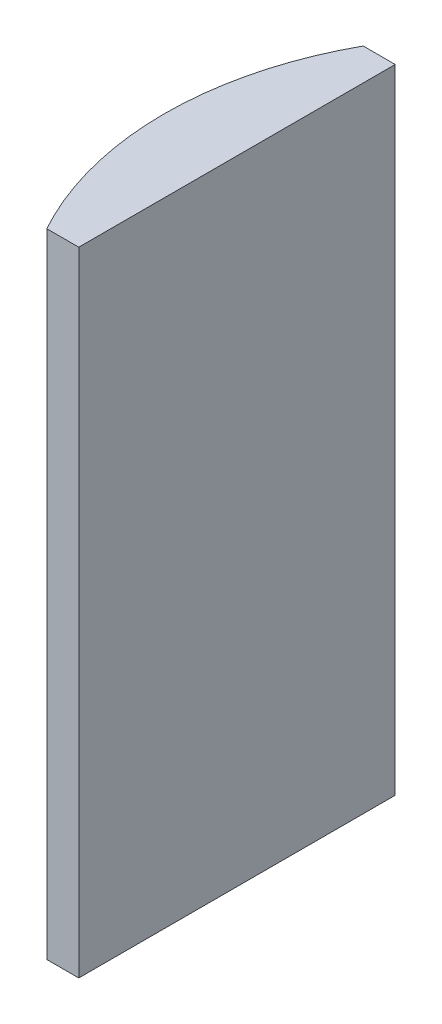
ISO-10303-21;
HEADER;
FILE_DESCRIPTION(('STEP AP214'),'2;1');
FILE_NAME('part.step','',(''),(''),'','','');
FILE_SCHEMA(('AUTOMOTIVE_DESIGN { 1 0 10303 214 1 1 1 1 }'));
ENDSEC;
DATA;
#1=APPLICATION_CONTEXT('core data for automotive mechanical design processes');
#2=APPLICATION_PROTOCOL_DEFINITION('international standard','automotive_design',2000,#1);
#3=PRODUCT_CONTEXT('',#1,'mechanical');
#4=PRODUCT('Part','Part','',(#3));
#5=PRODUCT_RELATED_PRODUCT_CATEGORY('part','',(#4));
#6=PRODUCT_DEFINITION_FORMATION('','',#4);
#7=PRODUCT_DEFINITION_CONTEXT('part definition',#1,'design');
#8=PRODUCT_DEFINITION('design','',#6,#7);
#9=PRODUCT_DEFINITION_SHAPE('','',#8);
#10=(LENGTH_UNIT() NAMED_UNIT(*) SI_UNIT(.MILLI.,.METRE.));
#11=(NAMED_UNIT(*) PLANE_ANGLE_UNIT() SI_UNIT($,.RADIAN.));
#12=(NAMED_UNIT(*) SI_UNIT($,.STERADIAN.) SOLID_ANGLE_UNIT());
#13=UNCERTAINTY_MEASURE_WITH_UNIT(LENGTH_MEASURE(1.E-05),#10,'distance_accuracy_value','');
#14=(GEOMETRIC_REPRESENTATION_CONTEXT(3) GLOBAL_UNCERTAINTY_ASSIGNED_CONTEXT((#13)) GLOBAL_UNIT_ASSIGNED_CONTEXT((#10,
#11,#12)) REPRESENTATION_CONTEXT('',''));
#15=CARTESIAN_POINT('',(0.,0.,0.));
#16=DIRECTION('',(0.,0.,1.));
#17=DIRECTION('',(1.,0.,0.));
#18=AXIS2_PLACEMENT_3D('',#15,#16,#17);
#19=CARTESIAN_POINT('',(4.35520433485127,40.,0.));
#20=DIRECTION('',(0.,-1.,0.));
#21=DIRECTION('',(0.,0.,-1.));
#22=AXIS2_PLACEMENT_3D('',#19,#20,#21);
#23=CYLINDRICAL_SURFACE('',#22,20.68);
#24=CARTESIAN_POINT('',(4.35520433485127,0.,0.));
#25=DIRECTION('',(0.,1.,0.));
#26=DIRECTION('',(0.,0.,1.));
#27=AXIS2_PLACEMENT_3D('',#24,#25,#26);
#28=CIRCLE('',#27,20.68);
#29=CARTESIAN_POINT('',(-13.7462431210844,0.,-10.));
#30=VERTEX_POINT('',#29);
#31=CARTESIAN_POINT('',(-13.7462431210844,0.,10.));
#32=VERTEX_POINT('',#31);
#33=EDGE_CURVE('E100',#30,#32,#28,.T.);
#34=ORIENTED_EDGE('',*,*,#33,.T.);
#35=DIRECTION('',(0.,-1.,0.));
#36=VECTOR('',#35,1.);
#37=CARTESIAN_POINT('',(-13.7462431210844,40.,10.));
#38=LINE('',#37,#36);
#39=CARTESIAN_POINT('',(-13.7462431210844,40.,10.));
#40=VERTEX_POINT('',#39);
#41=EDGE_CURVE('E11',#40,#32,#38,.T.);
#42=ORIENTED_EDGE('',*,*,#41,.F.);
#43=CARTESIAN_POINT('',(4.35520433485127,40.,0.));
#44=DIRECTION('',(0.,1.,0.));
#45=DIRECTION('',(0.,0.,1.));
#46=AXIS2_PLACEMENT_3D('',#43,#44,#45);
#47=CIRCLE('',#46,20.68);
#48=CARTESIAN_POINT('',(-13.7462431210844,40.,-10.));
#49=VERTEX_POINT('',#48);
#50=EDGE_CURVE('E88',#49,#40,#47,.T.);
#51=ORIENTED_EDGE('',*,*,#50,.F.);
#52=DIRECTION('',(0.,-1.,0.));
#53=VECTOR('',#52,1.);
#54=CARTESIAN_POINT('',(-13.7462431210844,40.,-10.));
#55=LINE('',#54,#53);
#56=EDGE_CURVE('E96',#49,#30,#55,.T.);
#57=ORIENTED_EDGE('',*,*,#56,.T.);
#58=EDGE_LOOP('',(#34,#42,#51,#57));
#59=FACE_BOUND('',#58,.T.);
#60=ADVANCED_FACE('F37',(#59),#23,.T.);
#61=CARTESIAN_POINT('',(-13.7462431210844,40.,10.));
#62=DIRECTION('',(0.,0.,-1.));
#63=DIRECTION('',(-1.,0.,0.));
#64=AXIS2_PLACEMENT_3D('',#61,#62,#63);
#65=PLANE('',#64);
#66=DIRECTION('',(1.,0.,0.));
#67=VECTOR('',#66,1.);
#68=CARTESIAN_POINT('',(-13.7462431210844,0.,10.));
#69=LINE('',#68,#67);
#70=CARTESIAN_POINT('',(-11.7247956651487,0.,10.));
#71=VERTEX_POINT('',#70);
#72=EDGE_CURVE('E92',#32,#71,#69,.T.);
#73=ORIENTED_EDGE('',*,*,#72,.T.);
#74=DIRECTION('',(0.,-1.,0.));
#75=VECTOR('',#74,1.);
#76=CARTESIAN_POINT('',(-11.7247956651487,40.,10.));
#77=LINE('',#76,#75);
#78=CARTESIAN_POINT('',(-11.7247956651487,40.,10.));
#79=VERTEX_POINT('',#78);
#80=EDGE_CURVE('E45',#79,#71,#77,.T.);
#81=ORIENTED_EDGE('',*,*,#80,.F.);
#82=DIRECTION('',(1.,0.,0.));
#83=VECTOR('',#82,1.);
#84=CARTESIAN_POINT('',(-13.7462431210844,40.,10.));
#85=LINE('',#84,#83);
#86=EDGE_CURVE('E83',#40,#79,#85,.T.);
#87=ORIENTED_EDGE('',*,*,#86,.F.);
#88=ORIENTED_EDGE('',*,*,#41,.T.);
#89=EDGE_LOOP('',(#73,#81,#87,#88));
#90=FACE_BOUND('',#89,.T.);
#91=ADVANCED_FACE('F91',(#90),#65,.F.);
#92=CARTESIAN_POINT('',(-11.7247956651487,40.,-10.));
#93=DIRECTION('',(-1.,0.,0.));
#94=DIRECTION('',(0.,0.,1.));
#95=AXIS2_PLACEMENT_3D('',#92,#93,#94);
#96=PLANE('',#95);
#97=DIRECTION('',(0.,0.,-1.));
#98=VECTOR('',#97,1.);
#99=CARTESIAN_POINT('',(-11.7247956651487,0.,-10.));
#100=LINE('',#99,#98);
#101=CARTESIAN_POINT('',(-11.7247956651487,0.,-10.));
#102=VERTEX_POINT('',#101);
#103=EDGE_CURVE('E70',#71,#102,#100,.T.);
#104=ORIENTED_EDGE('',*,*,#103,.T.);
#105=DIRECTION('',(0.,-1.,0.));
#106=VECTOR('',#105,1.);
#107=CARTESIAN_POINT('',(-11.7247956651487,40.,-10.));
#108=LINE('',#107,#106);
#109=CARTESIAN_POINT('',(-11.7247956651487,40.,-10.));
#110=VERTEX_POINT('',#109);
#111=EDGE_CURVE('E93',#110,#102,#108,.T.);
#112=ORIENTED_EDGE('',*,*,#111,.F.);
#113=DIRECTION('',(0.,0.,-1.));
#114=VECTOR('',#113,1.);
#115=CARTESIAN_POINT('',(-11.7247956651487,40.,-10.));
#116=LINE('',#115,#114);
#117=EDGE_CURVE('E86',#79,#110,#116,.T.);
#118=ORIENTED_EDGE('',*,*,#117,.F.);
#119=ORIENTED_EDGE('',*,*,#80,.T.);
#120=EDGE_LOOP('',(#104,#112,#118,#119));
#121=FACE_BOUND('',#120,.T.);
#122=ADVANCED_FACE('F94',(#121),#96,.F.);
#123=CARTESIAN_POINT('',(-13.7462431210844,40.,-10.));
#124=DIRECTION('',(0.,0.,1.));
#125=DIRECTION('',(1.,0.,0.));
#126=AXIS2_PLACEMENT_3D('',#123,#124,#125);
#127=PLANE('',#126);
#128=DIRECTION('',(-1.,0.,0.));
#129=VECTOR('',#128,1.);
#130=CARTESIAN_POINT('',(-13.7462431210844,0.,-10.));
#131=LINE('',#130,#129);
#132=EDGE_CURVE('E76',#102,#30,#131,.T.);
#133=ORIENTED_EDGE('',*,*,#132,.T.);
#134=ORIENTED_EDGE('',*,*,#56,.F.);
#135=DIRECTION('',(-1.,0.,0.));
#136=VECTOR('',#135,1.);
#137=CARTESIAN_POINT('',(-13.7462431210844,40.,-10.));
#138=LINE('',#137,#136);
#139=EDGE_CURVE('E53',#110,#49,#138,.T.);
#140=ORIENTED_EDGE('',*,*,#139,.F.);
#141=ORIENTED_EDGE('',*,*,#111,.T.);
#142=EDGE_LOOP('',(#133,#134,#140,#141));
#143=FACE_BOUND('',#142,.T.);
#144=ADVANCED_FACE('F107',(#143),#127,.F.);
#145=CARTESIAN_POINT('',(4.35520433485127,40.,0.));
#146=DIRECTION('',(0.,1.,0.));
#147=DIRECTION('',(0.,0.,1.));
#148=AXIS2_PLACEMENT_3D('',#145,#146,#147);
#149=PLANE('',#148);
#150=ORIENTED_EDGE('',*,*,#50,.T.);
#151=ORIENTED_EDGE('',*,*,#86,.T.);
#152=ORIENTED_EDGE('',*,*,#117,.T.);
#153=ORIENTED_EDGE('',*,*,#139,.T.);
#154=EDGE_LOOP('',(#150,#151,#152,#153));
#155=FACE_BOUND('',#154,.T.);
#156=ADVANCED_FACE('F84',(#155),#149,.T.);
#157=CARTESIAN_POINT('',(4.35520433485127,0.,0.));
#158=DIRECTION('',(0.,1.,0.));
#159=DIRECTION('',(0.,0.,1.));
#160=AXIS2_PLACEMENT_3D('',#157,#158,#159);
#161=PLANE('',#160);
#162=ORIENTED_EDGE('',*,*,#33,.F.);
#163=ORIENTED_EDGE('',*,*,#132,.F.);
#164=ORIENTED_EDGE('',*,*,#103,.F.);
#165=ORIENTED_EDGE('',*,*,#72,.F.);
#166=EDGE_LOOP('',(#162,#163,#164,#165));
#167=FACE_BOUND('',#166,.T.);
#168=ADVANCED_FACE('F110',(#167),#161,.F.);
#169=CLOSED_SHELL('',(#60,#91,#122,#144,#156,#168));
#170=MANIFOLD_SOLID_BREP('B2',#169);
#171=ADVANCED_BREP_SHAPE_REPRESENTATION('',(#18,#170),#14);
#172=SHAPE_DEFINITION_REPRESENTATION(#9,#171);
ENDSEC;
END-ISO-10303-21;
